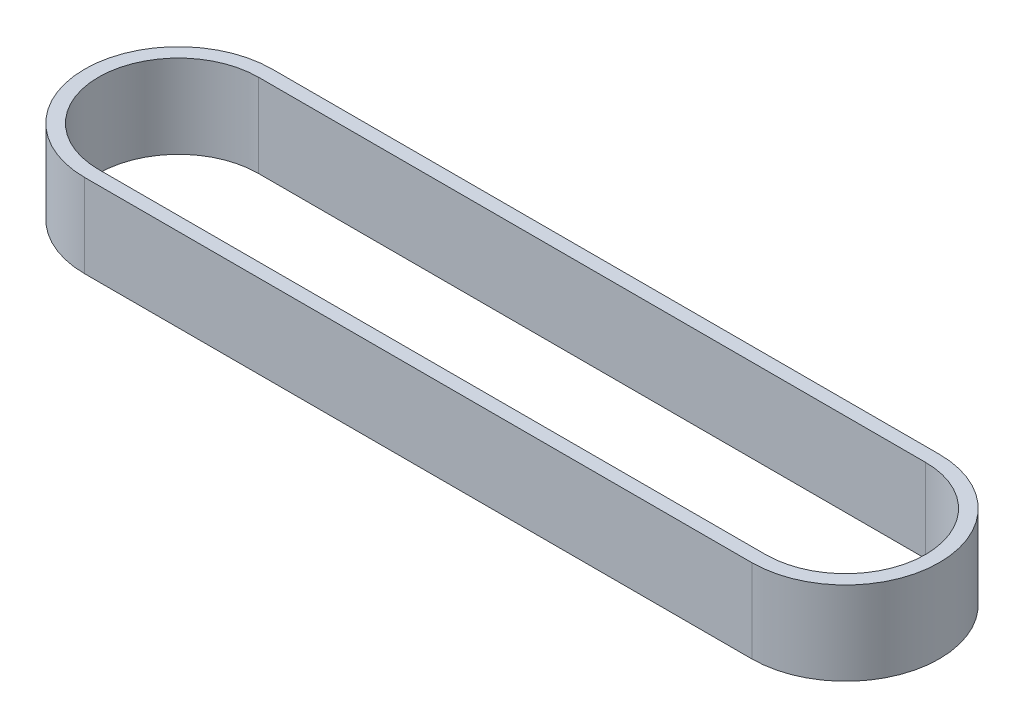
ISO-10303-21;
HEADER;
FILE_DESCRIPTION(('STEP AP214'),'2;1');
FILE_NAME('part.step','',(''),(''),'','','');
FILE_SCHEMA(('AUTOMOTIVE_DESIGN { 1 0 10303 214 1 1 1 1 }'));
ENDSEC;
DATA;
#1=APPLICATION_CONTEXT('core data for automotive mechanical design processes');
#2=APPLICATION_PROTOCOL_DEFINITION('international standard','automotive_design',2000,#1);
#3=PRODUCT_CONTEXT('',#1,'mechanical');
#4=PRODUCT('Part','Part','',(#3));
#5=PRODUCT_RELATED_PRODUCT_CATEGORY('part','',(#4));
#6=PRODUCT_DEFINITION_FORMATION('','',#4);
#7=PRODUCT_DEFINITION_CONTEXT('part definition',#1,'design');
#8=PRODUCT_DEFINITION('design','',#6,#7);
#9=PRODUCT_DEFINITION_SHAPE('','',#8);
#10=(LENGTH_UNIT() NAMED_UNIT(*) SI_UNIT(.MILLI.,.METRE.));
#11=(NAMED_UNIT(*) PLANE_ANGLE_UNIT() SI_UNIT($,.RADIAN.));
#12=(NAMED_UNIT(*) SI_UNIT($,.STERADIAN.) SOLID_ANGLE_UNIT());
#13=UNCERTAINTY_MEASURE_WITH_UNIT(LENGTH_MEASURE(1.E-05),#10,'distance_accuracy_value','');
#14=(GEOMETRIC_REPRESENTATION_CONTEXT(3) GLOBAL_UNCERTAINTY_ASSIGNED_CONTEXT((#13)) GLOBAL_UNIT_ASSIGNED_CONTEXT((#10,
#11,#12)) REPRESENTATION_CONTEXT('',''));
#15=CARTESIAN_POINT('',(0.,0.,0.));
#16=DIRECTION('',(0.,0.,1.));
#17=DIRECTION('',(1.,0.,0.));
#18=AXIS2_PLACEMENT_3D('',#15,#16,#17);
#19=CARTESIAN_POINT('',(0.,6.,0.));
#20=DIRECTION('',(0.,1.,0.));
#21=DIRECTION('',(0.,0.,1.));
#22=AXIS2_PLACEMENT_3D('',#19,#20,#21);
#23=PLANE('',#22);
#24=CARTESIAN_POINT('',(0.,6.,0.));
#25=DIRECTION('',(0.,1.,0.));
#26=DIRECTION('',(0.,0.,1.));
#27=AXIS2_PLACEMENT_3D('',#24,#25,#26);
#28=CIRCLE('',#27,6.75);
#29=CARTESIAN_POINT('',(0.,6.,-6.75));
#30=VERTEX_POINT('',#29);
#31=CARTESIAN_POINT('',(0.,6.,6.75));
#32=VERTEX_POINT('',#31);
#33=EDGE_CURVE('E131',#30,#32,#28,.T.);
#34=ORIENTED_EDGE('',*,*,#33,.T.);
#35=DIRECTION('',(1.,0.,0.));
#36=VECTOR('',#35,1.);
#37=CARTESIAN_POINT('',(0.,6.,6.75));
#38=LINE('',#37,#36);
#39=CARTESIAN_POINT('',(48.,6.,6.75));
#40=VERTEX_POINT('',#39);
#41=EDGE_CURVE('E134',#32,#40,#38,.T.);
#42=ORIENTED_EDGE('',*,*,#41,.T.);
#43=CARTESIAN_POINT('',(48.,6.,0.));
#44=DIRECTION('',(0.,1.,0.));
#45=DIRECTION('',(0.,0.,1.));
#46=AXIS2_PLACEMENT_3D('',#43,#44,#45);
#47=CIRCLE('',#46,6.75);
#48=CARTESIAN_POINT('',(48.,6.,-6.75));
#49=VERTEX_POINT('',#48);
#50=EDGE_CURVE('E137',#40,#49,#47,.T.);
#51=ORIENTED_EDGE('',*,*,#50,.T.);
#52=DIRECTION('',(-1.,0.,0.));
#53=VECTOR('',#52,1.);
#54=CARTESIAN_POINT('',(0.,6.,-6.75));
#55=LINE('',#54,#53);
#56=EDGE_CURVE('E139',#49,#30,#55,.T.);
#57=ORIENTED_EDGE('',*,*,#56,.T.);
#58=EDGE_LOOP('',(#34,#42,#51,#57));
#59=FACE_BOUND('',#58,.T.);
#60=DIRECTION('',(1.,0.,0.));
#61=VECTOR('',#60,1.);
#62=CARTESIAN_POINT('',(0.,6.,5.75));
#63=LINE('',#62,#61);
#64=CARTESIAN_POINT('',(0.,6.,5.75));
#65=VERTEX_POINT('',#64);
#66=CARTESIAN_POINT('',(48.,6.,5.75));
#67=VERTEX_POINT('',#66);
#68=EDGE_CURVE('E103',#65,#67,#63,.T.);
#69=ORIENTED_EDGE('',*,*,#68,.F.);
#70=CARTESIAN_POINT('',(0.,6.,0.));
#71=DIRECTION('',(0.,1.,0.));
#72=DIRECTION('',(0.,0.,1.));
#73=AXIS2_PLACEMENT_3D('',#70,#71,#72);
#74=CIRCLE('',#73,5.75);
#75=CARTESIAN_POINT('',(0.,6.,-5.75));
#76=VERTEX_POINT('',#75);
#77=EDGE_CURVE('E95',#76,#65,#74,.T.);
#78=ORIENTED_EDGE('',*,*,#77,.F.);
#79=DIRECTION('',(-1.,0.,0.));
#80=VECTOR('',#79,1.);
#81=CARTESIAN_POINT('',(0.,6.,-5.75));
#82=LINE('',#81,#80);
#83=CARTESIAN_POINT('',(48.,6.,-5.75));
#84=VERTEX_POINT('',#83);
#85=EDGE_CURVE('E117',#84,#76,#82,.T.);
#86=ORIENTED_EDGE('',*,*,#85,.F.);
#87=CARTESIAN_POINT('',(48.,6.,0.));
#88=DIRECTION('',(0.,1.,0.));
#89=DIRECTION('',(0.,0.,1.));
#90=AXIS2_PLACEMENT_3D('',#87,#88,#89);
#91=CIRCLE('',#90,5.75);
#92=EDGE_CURVE('E115',#67,#84,#91,.T.);
#93=ORIENTED_EDGE('',*,*,#92,.F.);
#94=EDGE_LOOP('',(#69,#78,#86,#93));
#95=FACE_BOUND('',#94,.T.);
#96=ADVANCED_FACE('F30',(#59,#95),#23,.T.);
#97=CARTESIAN_POINT('',(0.,0.,0.));
#98=DIRECTION('',(0.,1.,0.));
#99=DIRECTION('',(0.,0.,1.));
#100=AXIS2_PLACEMENT_3D('',#97,#98,#99);
#101=PLANE('',#100);
#102=CARTESIAN_POINT('',(0.,0.,0.));
#103=DIRECTION('',(0.,1.,0.));
#104=DIRECTION('',(0.,0.,1.));
#105=AXIS2_PLACEMENT_3D('',#102,#103,#104);
#106=CIRCLE('',#105,6.75);
#107=CARTESIAN_POINT('',(0.,0.,-6.75));
#108=VERTEX_POINT('',#107);
#109=CARTESIAN_POINT('',(0.,0.,6.75));
#110=VERTEX_POINT('',#109);
#111=EDGE_CURVE('E111',#108,#110,#106,.T.);
#112=ORIENTED_EDGE('',*,*,#111,.F.);
#113=DIRECTION('',(-1.,0.,0.));
#114=VECTOR('',#113,1.);
#115=CARTESIAN_POINT('',(0.,0.,-6.75));
#116=LINE('',#115,#114);
#117=CARTESIAN_POINT('',(48.,0.,-6.75));
#118=VERTEX_POINT('',#117);
#119=EDGE_CURVE('E135',#118,#108,#116,.T.);
#120=ORIENTED_EDGE('',*,*,#119,.F.);
#121=CARTESIAN_POINT('',(48.,0.,0.));
#122=DIRECTION('',(0.,1.,0.));
#123=DIRECTION('',(0.,0.,1.));
#124=AXIS2_PLACEMENT_3D('',#121,#122,#123);
#125=CIRCLE('',#124,6.75);
#126=CARTESIAN_POINT('',(48.,0.,6.75));
#127=VERTEX_POINT('',#126);
#128=EDGE_CURVE('E146',#127,#118,#125,.T.);
#129=ORIENTED_EDGE('',*,*,#128,.F.);
#130=DIRECTION('',(1.,0.,0.));
#131=VECTOR('',#130,1.);
#132=CARTESIAN_POINT('',(0.,0.,6.75));
#133=LINE('',#132,#131);
#134=EDGE_CURVE('E144',#110,#127,#133,.T.);
#135=ORIENTED_EDGE('',*,*,#134,.F.);
#136=EDGE_LOOP('',(#112,#120,#129,#135));
#137=FACE_BOUND('',#136,.T.);
#138=CARTESIAN_POINT('',(0.,0.,0.));
#139=DIRECTION('',(0.,1.,0.));
#140=DIRECTION('',(0.,0.,1.));
#141=AXIS2_PLACEMENT_3D('',#138,#139,#140);
#142=CIRCLE('',#141,5.75);
#143=CARTESIAN_POINT('',(0.,0.,-5.75));
#144=VERTEX_POINT('',#143);
#145=CARTESIAN_POINT('',(0.,0.,5.75));
#146=VERTEX_POINT('',#145);
#147=EDGE_CURVE('E53',#144,#146,#142,.T.);
#148=ORIENTED_EDGE('',*,*,#147,.T.);
#149=DIRECTION('',(1.,0.,0.));
#150=VECTOR('',#149,1.);
#151=CARTESIAN_POINT('',(0.,0.,5.75));
#152=LINE('',#151,#150);
#153=CARTESIAN_POINT('',(48.,0.,5.75));
#154=VERTEX_POINT('',#153);
#155=EDGE_CURVE('E110',#146,#154,#152,.T.);
#156=ORIENTED_EDGE('',*,*,#155,.T.);
#157=CARTESIAN_POINT('',(48.,0.,0.));
#158=DIRECTION('',(0.,1.,0.));
#159=DIRECTION('',(0.,0.,1.));
#160=AXIS2_PLACEMENT_3D('',#157,#158,#159);
#161=CIRCLE('',#160,5.75);
#162=CARTESIAN_POINT('',(48.,0.,-5.75));
#163=VERTEX_POINT('',#162);
#164=EDGE_CURVE('E123',#154,#163,#161,.T.);
#165=ORIENTED_EDGE('',*,*,#164,.T.);
#166=DIRECTION('',(-1.,0.,0.));
#167=VECTOR('',#166,1.);
#168=CARTESIAN_POINT('',(0.,0.,-5.75));
#169=LINE('',#168,#167);
#170=EDGE_CURVE('E104',#163,#144,#169,.T.);
#171=ORIENTED_EDGE('',*,*,#170,.T.);
#172=EDGE_LOOP('',(#148,#156,#165,#171));
#173=FACE_BOUND('',#172,.T.);
#174=ADVANCED_FACE('F164',(#137,#173),#101,.F.);
#175=CARTESIAN_POINT('',(0.,6.,0.));
#176=DIRECTION('',(0.,-1.,0.));
#177=DIRECTION('',(0.,0.,-1.));
#178=AXIS2_PLACEMENT_3D('',#175,#176,#177);
#179=CYLINDRICAL_SURFACE('',#178,6.75);
#180=ORIENTED_EDGE('',*,*,#111,.T.);
#181=DIRECTION('',(0.,-1.,0.));
#182=VECTOR('',#181,1.);
#183=CARTESIAN_POINT('',(0.,6.,6.75));
#184=LINE('',#183,#182);
#185=EDGE_CURVE('E11',#32,#110,#184,.T.);
#186=ORIENTED_EDGE('',*,*,#185,.F.);
#187=ORIENTED_EDGE('',*,*,#33,.F.);
#188=DIRECTION('',(0.,-1.,0.));
#189=VECTOR('',#188,1.);
#190=CARTESIAN_POINT('',(0.,6.,-6.75));
#191=LINE('',#190,#189);
#192=EDGE_CURVE('E141',#30,#108,#191,.T.);
#193=ORIENTED_EDGE('',*,*,#192,.T.);
#194=EDGE_LOOP('',(#180,#186,#187,#193));
#195=FACE_BOUND('',#194,.T.);
#196=ADVANCED_FACE('F32',(#195),#179,.T.);
#197=CARTESIAN_POINT('',(0.,6.,6.75));
#198=DIRECTION('',(0.,0.,-1.));
#199=DIRECTION('',(-1.,0.,0.));
#200=AXIS2_PLACEMENT_3D('',#197,#198,#199);
#201=PLANE('',#200);
#202=ORIENTED_EDGE('',*,*,#134,.T.);
#203=DIRECTION('',(0.,-1.,0.));
#204=VECTOR('',#203,1.);
#205=CARTESIAN_POINT('',(48.,6.,6.75));
#206=LINE('',#205,#204);
#207=EDGE_CURVE('E38',#40,#127,#206,.T.);
#208=ORIENTED_EDGE('',*,*,#207,.F.);
#209=ORIENTED_EDGE('',*,*,#41,.F.);
#210=ORIENTED_EDGE('',*,*,#185,.T.);
#211=EDGE_LOOP('',(#202,#208,#209,#210));
#212=FACE_BOUND('',#211,.T.);
#213=ADVANCED_FACE('F174',(#212),#201,.F.);
#214=CARTESIAN_POINT('',(48.,6.,0.));
#215=DIRECTION('',(0.,-1.,0.));
#216=DIRECTION('',(0.,0.,-1.));
#217=AXIS2_PLACEMENT_3D('',#214,#215,#216);
#218=CYLINDRICAL_SURFACE('',#217,6.75);
#219=ORIENTED_EDGE('',*,*,#128,.T.);
#220=DIRECTION('',(0.,-1.,0.));
#221=VECTOR('',#220,1.);
#222=CARTESIAN_POINT('',(48.,6.,-6.75));
#223=LINE('',#222,#221);
#224=EDGE_CURVE('E151',#49,#118,#223,.T.);
#225=ORIENTED_EDGE('',*,*,#224,.F.);
#226=ORIENTED_EDGE('',*,*,#50,.F.);
#227=ORIENTED_EDGE('',*,*,#207,.T.);
#228=EDGE_LOOP('',(#219,#225,#226,#227));
#229=FACE_BOUND('',#228,.T.);
#230=ADVANCED_FACE('F158',(#229),#218,.T.);
#231=CARTESIAN_POINT('',(0.,6.,-6.75));
#232=DIRECTION('',(0.,0.,1.));
#233=DIRECTION('',(1.,0.,0.));
#234=AXIS2_PLACEMENT_3D('',#231,#232,#233);
#235=PLANE('',#234);
#236=ORIENTED_EDGE('',*,*,#119,.T.);
#237=ORIENTED_EDGE('',*,*,#192,.F.);
#238=ORIENTED_EDGE('',*,*,#56,.F.);
#239=ORIENTED_EDGE('',*,*,#224,.T.);
#240=EDGE_LOOP('',(#236,#237,#238,#239));
#241=FACE_BOUND('',#240,.T.);
#242=ADVANCED_FACE('F168',(#241),#235,.F.);
#243=CARTESIAN_POINT('',(0.,6.,0.));
#244=DIRECTION('',(0.,-1.,0.));
#245=DIRECTION('',(0.,0.,-1.));
#246=AXIS2_PLACEMENT_3D('',#243,#244,#245);
#247=CYLINDRICAL_SURFACE('',#246,5.75);
#248=ORIENTED_EDGE('',*,*,#147,.F.);
#249=DIRECTION('',(0.,-1.,0.));
#250=VECTOR('',#249,1.);
#251=CARTESIAN_POINT('',(0.,6.,-5.75));
#252=LINE('',#251,#250);
#253=EDGE_CURVE('E99',#76,#144,#252,.T.);
#254=ORIENTED_EDGE('',*,*,#253,.F.);
#255=ORIENTED_EDGE('',*,*,#77,.T.);
#256=DIRECTION('',(0.,-1.,0.));
#257=VECTOR('',#256,1.);
#258=CARTESIAN_POINT('',(0.,6.,5.75));
#259=LINE('',#258,#257);
#260=EDGE_CURVE('E98',#65,#146,#259,.T.);
#261=ORIENTED_EDGE('',*,*,#260,.T.);
#262=EDGE_LOOP('',(#248,#254,#255,#261));
#263=FACE_BOUND('',#262,.T.);
#264=ADVANCED_FACE('F97',(#263),#247,.F.);
#265=CARTESIAN_POINT('',(0.,6.,5.75));
#266=DIRECTION('',(0.,0.,-1.));
#267=DIRECTION('',(-1.,0.,0.));
#268=AXIS2_PLACEMENT_3D('',#265,#266,#267);
#269=PLANE('',#268);
#270=ORIENTED_EDGE('',*,*,#155,.F.);
#271=ORIENTED_EDGE('',*,*,#260,.F.);
#272=ORIENTED_EDGE('',*,*,#68,.T.);
#273=DIRECTION('',(0.,-1.,0.));
#274=VECTOR('',#273,1.);
#275=CARTESIAN_POINT('',(48.,6.,5.75));
#276=LINE('',#275,#274);
#277=EDGE_CURVE('E112',#67,#154,#276,.T.);
#278=ORIENTED_EDGE('',*,*,#277,.T.);
#279=EDGE_LOOP('',(#270,#271,#272,#278));
#280=FACE_BOUND('',#279,.T.);
#281=ADVANCED_FACE('F107',(#280),#269,.T.);
#282=CARTESIAN_POINT('',(48.,6.,0.));
#283=DIRECTION('',(0.,-1.,0.));
#284=DIRECTION('',(0.,0.,-1.));
#285=AXIS2_PLACEMENT_3D('',#282,#283,#284);
#286=CYLINDRICAL_SURFACE('',#285,5.75);
#287=ORIENTED_EDGE('',*,*,#164,.F.);
#288=ORIENTED_EDGE('',*,*,#277,.F.);
#289=ORIENTED_EDGE('',*,*,#92,.T.);
#290=DIRECTION('',(0.,-1.,0.));
#291=VECTOR('',#290,1.);
#292=CARTESIAN_POINT('',(48.,6.,-5.75));
#293=LINE('',#292,#291);
#294=EDGE_CURVE('E45',#84,#163,#293,.T.);
#295=ORIENTED_EDGE('',*,*,#294,.T.);
#296=EDGE_LOOP('',(#287,#288,#289,#295));
#297=FACE_BOUND('',#296,.T.);
#298=ADVANCED_FACE('F197',(#297),#286,.F.);
#299=CARTESIAN_POINT('',(0.,6.,-5.75));
#300=DIRECTION('',(0.,0.,1.));
#301=DIRECTION('',(1.,0.,0.));
#302=AXIS2_PLACEMENT_3D('',#299,#300,#301);
#303=PLANE('',#302);
#304=ORIENTED_EDGE('',*,*,#170,.F.);
#305=ORIENTED_EDGE('',*,*,#294,.F.);
#306=ORIENTED_EDGE('',*,*,#85,.T.);
#307=ORIENTED_EDGE('',*,*,#253,.T.);
#308=EDGE_LOOP('',(#304,#305,#306,#307));
#309=FACE_BOUND('',#308,.T.);
#310=ADVANCED_FACE('F201',(#309),#303,.T.);
#311=CLOSED_SHELL('',(#96,#174,#196,#213,#230,#242,#264,#281,#298,#310));
#312=MANIFOLD_SOLID_BREP('B2',#311);
#313=ADVANCED_BREP_SHAPE_REPRESENTATION('',(#18,#312),#14);
#314=SHAPE_DEFINITION_REPRESENTATION(#9,#313);
ENDSEC;
END-ISO-10303-21;
